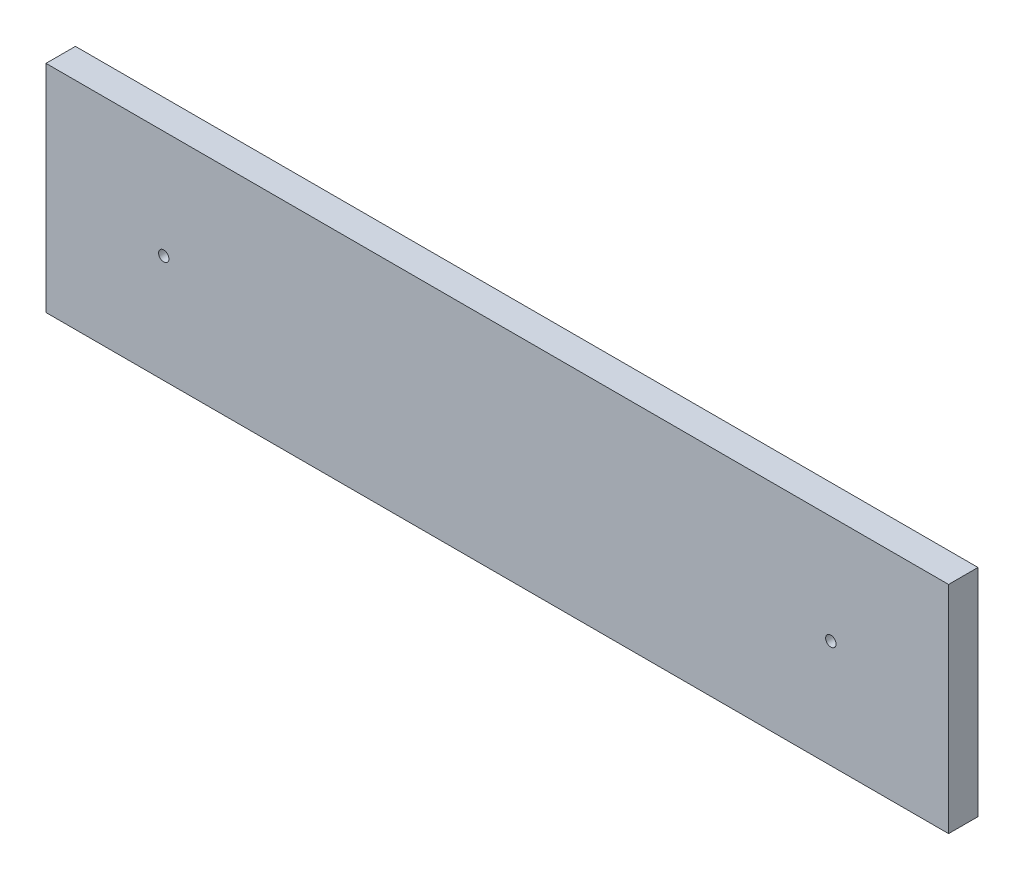
ISO-10303-21;
HEADER;
FILE_DESCRIPTION(('STEP AP214'),'2;1');
FILE_NAME('part.step','',(''),(''),'','','');
FILE_SCHEMA(('AUTOMOTIVE_DESIGN { 1 0 10303 214 1 1 1 1 }'));
ENDSEC;
DATA;
#1=APPLICATION_CONTEXT('core data for automotive mechanical design processes');
#2=APPLICATION_PROTOCOL_DEFINITION('international standard','automotive_design',2000,#1);
#3=PRODUCT_CONTEXT('',#1,'mechanical');
#4=PRODUCT('Part','Part','',(#3));
#5=PRODUCT_RELATED_PRODUCT_CATEGORY('part','',(#4));
#6=PRODUCT_DEFINITION_FORMATION('','',#4);
#7=PRODUCT_DEFINITION_CONTEXT('part definition',#1,'design');
#8=PRODUCT_DEFINITION('design','',#6,#7);
#9=PRODUCT_DEFINITION_SHAPE('','',#8);
#10=(LENGTH_UNIT() NAMED_UNIT(*) SI_UNIT(.MILLI.,.METRE.));
#11=(NAMED_UNIT(*) PLANE_ANGLE_UNIT() SI_UNIT($,.RADIAN.));
#12=(NAMED_UNIT(*) SI_UNIT($,.STERADIAN.) SOLID_ANGLE_UNIT());
#13=UNCERTAINTY_MEASURE_WITH_UNIT(LENGTH_MEASURE(1.E-05),#10,'distance_accuracy_value','');
#14=(GEOMETRIC_REPRESENTATION_CONTEXT(3) GLOBAL_UNCERTAINTY_ASSIGNED_CONTEXT((#13)) GLOBAL_UNIT_ASSIGNED_CONTEXT((#10,
#11,#12)) REPRESENTATION_CONTEXT('',''));
#15=CARTESIAN_POINT('',(0.,0.,0.));
#16=DIRECTION('',(0.,0.,1.));
#17=DIRECTION('',(1.,0.,0.));
#18=AXIS2_PLACEMENT_3D('',#15,#16,#17);
#19=CARTESIAN_POINT('',(0.,0.,-19.05));
#20=DIRECTION('',(0.,0.,-1.));
#21=DIRECTION('',(-1.,0.,0.));
#22=AXIS2_PLACEMENT_3D('',#19,#20,#21);
#23=PLANE('',#22);
#24=CARTESIAN_POINT('',(76.2,69.85,-19.05));
#25=DIRECTION('',(0.,0.,-1.));
#26=DIRECTION('',(-1.,0.,0.));
#27=AXIS2_PLACEMENT_3D('',#24,#25,#26);
#28=CIRCLE('',#27,3.3655);
#29=CARTESIAN_POINT('',(72.8345,69.85,-19.05));
#30=VERTEX_POINT('',#29);
#31=EDGE_CURVE('E83',#30,#30,#28,.F.);
#32=ORIENTED_EDGE('',*,*,#31,.T.);
#33=EDGE_LOOP('',(#32));
#34=FACE_BOUND('',#33,.T.);
#35=CARTESIAN_POINT('',(508.,69.85,-19.05));
#36=DIRECTION('',(0.,0.,-1.));
#37=DIRECTION('',(-1.,0.,0.));
#38=AXIS2_PLACEMENT_3D('',#35,#36,#37);
#39=CIRCLE('',#38,3.3655);
#40=CARTESIAN_POINT('',(504.6345,69.85,-19.05));
#41=VERTEX_POINT('',#40);
#42=EDGE_CURVE('E19',#41,#41,#39,.F.);
#43=ORIENTED_EDGE('',*,*,#42,.T.);
#44=EDGE_LOOP('',(#43));
#45=FACE_BOUND('',#44,.T.);
#46=DIRECTION('',(1.,0.,0.));
#47=VECTOR('',#46,1.);
#48=CARTESIAN_POINT('',(0.,0.,-19.05));
#49=LINE('',#48,#47);
#50=CARTESIAN_POINT('',(0.,0.,-19.05));
#51=VERTEX_POINT('',#50);
#52=CARTESIAN_POINT('',(584.2,0.,-19.05));
#53=VERTEX_POINT('',#52);
#54=EDGE_CURVE('E59',#51,#53,#49,.T.);
#55=ORIENTED_EDGE('',*,*,#54,.F.);
#56=DIRECTION('',(0.,1.,0.));
#57=VECTOR('',#56,1.);
#58=CARTESIAN_POINT('',(0.,0.,-19.05));
#59=LINE('',#58,#57);
#60=CARTESIAN_POINT('',(0.,139.7,-19.05));
#61=VERTEX_POINT('',#60);
#62=EDGE_CURVE('E92',#51,#61,#59,.T.);
#63=ORIENTED_EDGE('',*,*,#62,.T.);
#64=DIRECTION('',(1.,0.,0.));
#65=VECTOR('',#64,1.);
#66=CARTESIAN_POINT('',(0.,139.7,-19.05));
#67=LINE('',#66,#65);
#68=CARTESIAN_POINT('',(584.2,139.7,-19.05));
#69=VERTEX_POINT('',#68);
#70=EDGE_CURVE('E61',#69,#61,#67,.F.);
#71=ORIENTED_EDGE('',*,*,#70,.F.);
#72=DIRECTION('',(0.,1.,0.));
#73=VECTOR('',#72,1.);
#74=CARTESIAN_POINT('',(584.2,0.,-19.05));
#75=LINE('',#74,#73);
#76=EDGE_CURVE('E55',#53,#69,#75,.T.);
#77=ORIENTED_EDGE('',*,*,#76,.F.);
#78=EDGE_LOOP('',(#55,#63,#71,#77));
#79=FACE_BOUND('',#78,.T.);
#80=ADVANCED_FACE('F16',(#34,#45,#79),#23,.T.);
#81=CARTESIAN_POINT('',(0.,0.,0.));
#82=DIRECTION('',(0.,-1.,0.));
#83=DIRECTION('',(0.,0.,-1.));
#84=AXIS2_PLACEMENT_3D('',#81,#82,#83);
#85=PLANE('',#84);
#86=DIRECTION('',(1.,0.,0.));
#87=VECTOR('',#86,1.);
#88=CARTESIAN_POINT('',(0.,0.,0.));
#89=LINE('',#88,#87);
#90=CARTESIAN_POINT('',(0.,0.,0.));
#91=VERTEX_POINT('',#90);
#92=CARTESIAN_POINT('',(584.2,0.,0.));
#93=VERTEX_POINT('',#92);
#94=EDGE_CURVE('E85',#91,#93,#89,.T.);
#95=ORIENTED_EDGE('',*,*,#94,.F.);
#96=DIRECTION('',(0.,0.,-1.));
#97=VECTOR('',#96,1.);
#98=CARTESIAN_POINT('',(0.,0.,0.));
#99=LINE('',#98,#97);
#100=EDGE_CURVE('E69',#91,#51,#99,.T.);
#101=ORIENTED_EDGE('',*,*,#100,.T.);
#102=ORIENTED_EDGE('',*,*,#54,.T.);
#103=DIRECTION('',(0.,0.,-1.));
#104=VECTOR('',#103,1.);
#105=CARTESIAN_POINT('',(584.2,0.,0.));
#106=LINE('',#105,#104);
#107=EDGE_CURVE('E63',#93,#53,#106,.T.);
#108=ORIENTED_EDGE('',*,*,#107,.F.);
#109=EDGE_LOOP('',(#95,#101,#102,#108));
#110=FACE_BOUND('',#109,.T.);
#111=ADVANCED_FACE('F66',(#110),#85,.T.);
#112=CARTESIAN_POINT('',(584.2,0.,0.));
#113=DIRECTION('',(1.,0.,0.));
#114=DIRECTION('',(0.,0.,-1.));
#115=AXIS2_PLACEMENT_3D('',#112,#113,#114);
#116=PLANE('',#115);
#117=DIRECTION('',(0.,1.,0.));
#118=VECTOR('',#117,1.);
#119=CARTESIAN_POINT('',(584.2,139.7,0.));
#120=LINE('',#119,#118);
#121=CARTESIAN_POINT('',(584.2,139.7,0.));
#122=VERTEX_POINT('',#121);
#123=EDGE_CURVE('E74',#93,#122,#120,.T.);
#124=ORIENTED_EDGE('',*,*,#123,.F.);
#125=ORIENTED_EDGE('',*,*,#107,.T.);
#126=ORIENTED_EDGE('',*,*,#76,.T.);
#127=DIRECTION('',(0.,0.,1.));
#128=VECTOR('',#127,1.);
#129=CARTESIAN_POINT('',(584.2,139.7,-19.05));
#130=LINE('',#129,#128);
#131=EDGE_CURVE('E76',#122,#69,#130,.F.);
#132=ORIENTED_EDGE('',*,*,#131,.F.);
#133=EDGE_LOOP('',(#124,#125,#126,#132));
#134=FACE_BOUND('',#133,.T.);
#135=ADVANCED_FACE('F72',(#134),#116,.T.);
#136=CARTESIAN_POINT('',(0.,139.7,-19.05));
#137=DIRECTION('',(0.,1.,0.));
#138=DIRECTION('',(0.,0.,1.));
#139=AXIS2_PLACEMENT_3D('',#136,#137,#138);
#140=PLANE('',#139);
#141=ORIENTED_EDGE('',*,*,#70,.T.);
#142=DIRECTION('',(0.,0.,-1.));
#143=VECTOR('',#142,1.);
#144=CARTESIAN_POINT('',(0.,139.7,0.));
#145=LINE('',#144,#143);
#146=CARTESIAN_POINT('',(0.,139.7,0.));
#147=VERTEX_POINT('',#146);
#148=EDGE_CURVE('E34',#61,#147,#145,.F.);
#149=ORIENTED_EDGE('',*,*,#148,.T.);
#150=DIRECTION('',(1.,0.,0.));
#151=VECTOR('',#150,1.);
#152=CARTESIAN_POINT('',(0.,139.7,0.));
#153=LINE('',#152,#151);
#154=EDGE_CURVE('E103',#122,#147,#153,.F.);
#155=ORIENTED_EDGE('',*,*,#154,.F.);
#156=ORIENTED_EDGE('',*,*,#131,.T.);
#157=EDGE_LOOP('',(#141,#149,#155,#156));
#158=FACE_BOUND('',#157,.T.);
#159=ADVANCED_FACE('F97',(#158),#140,.T.);
#160=CARTESIAN_POINT('',(0.,0.,0.));
#161=DIRECTION('',(1.,0.,0.));
#162=DIRECTION('',(0.,0.,-1.));
#163=AXIS2_PLACEMENT_3D('',#160,#161,#162);
#164=PLANE('',#163);
#165=ORIENTED_EDGE('',*,*,#148,.F.);
#166=ORIENTED_EDGE('',*,*,#62,.F.);
#167=ORIENTED_EDGE('',*,*,#100,.F.);
#168=DIRECTION('',(0.,1.,0.));
#169=VECTOR('',#168,1.);
#170=CARTESIAN_POINT('',(0.,139.7,0.));
#171=LINE('',#170,#169);
#172=EDGE_CURVE('E82',#147,#91,#171,.F.);
#173=ORIENTED_EDGE('',*,*,#172,.F.);
#174=EDGE_LOOP('',(#165,#166,#167,#173));
#175=FACE_BOUND('',#174,.T.);
#176=ADVANCED_FACE('F99',(#175),#164,.F.);
#177=CARTESIAN_POINT('',(508.,69.85,-19.05));
#178=DIRECTION('',(0.,0.,-1.));
#179=DIRECTION('',(-1.,0.,0.));
#180=AXIS2_PLACEMENT_3D('',#177,#178,#179);
#181=CYLINDRICAL_SURFACE('',#180,3.3655);
#182=CARTESIAN_POINT('',(508.,69.85,0.));
#183=DIRECTION('',(0.,0.,-1.));
#184=DIRECTION('',(-1.,0.,0.));
#185=AXIS2_PLACEMENT_3D('',#182,#183,#184);
#186=CIRCLE('',#185,3.3655);
#187=CARTESIAN_POINT('',(504.6345,69.85,0.));
#188=VERTEX_POINT('',#187);
#189=EDGE_CURVE('E25',#188,#188,#186,.T.);
#190=ORIENTED_EDGE('',*,*,#189,.F.);
#191=EDGE_LOOP('',(#190));
#192=FACE_BOUND('',#191,.T.);
#193=ORIENTED_EDGE('',*,*,#42,.F.);
#194=EDGE_LOOP('',(#193));
#195=FACE_BOUND('',#194,.T.);
#196=ADVANCED_FACE('F115',(#192,#195),#181,.F.);
#197=CARTESIAN_POINT('',(76.2,69.85,-19.05));
#198=DIRECTION('',(0.,0.,-1.));
#199=DIRECTION('',(-1.,0.,0.));
#200=AXIS2_PLACEMENT_3D('',#197,#198,#199);
#201=CYLINDRICAL_SURFACE('',#200,3.3655);
#202=CARTESIAN_POINT('',(76.2,69.85,0.));
#203=DIRECTION('',(0.,0.,-1.));
#204=DIRECTION('',(-1.,0.,0.));
#205=AXIS2_PLACEMENT_3D('',#202,#203,#204);
#206=CIRCLE('',#205,3.3655);
#207=CARTESIAN_POINT('',(72.8345,69.85,0.));
#208=VERTEX_POINT('',#207);
#209=EDGE_CURVE('E11',#208,#208,#206,.T.);
#210=ORIENTED_EDGE('',*,*,#209,.F.);
#211=EDGE_LOOP('',(#210));
#212=FACE_BOUND('',#211,.T.);
#213=ORIENTED_EDGE('',*,*,#31,.F.);
#214=EDGE_LOOP('',(#213));
#215=FACE_BOUND('',#214,.T.);
#216=ADVANCED_FACE('F108',(#212,#215),#201,.F.);
#217=CARTESIAN_POINT('',(0.,139.7,0.));
#218=DIRECTION('',(0.,0.,1.));
#219=DIRECTION('',(1.,0.,0.));
#220=AXIS2_PLACEMENT_3D('',#217,#218,#219);
#221=PLANE('',#220);
#222=ORIENTED_EDGE('',*,*,#209,.T.);
#223=EDGE_LOOP('',(#222));
#224=FACE_BOUND('',#223,.T.);
#225=ORIENTED_EDGE('',*,*,#189,.T.);
#226=EDGE_LOOP('',(#225));
#227=FACE_BOUND('',#226,.T.);
#228=ORIENTED_EDGE('',*,*,#154,.T.);
#229=ORIENTED_EDGE('',*,*,#172,.T.);
#230=ORIENTED_EDGE('',*,*,#94,.T.);
#231=ORIENTED_EDGE('',*,*,#123,.T.);
#232=EDGE_LOOP('',(#228,#229,#230,#231));
#233=FACE_BOUND('',#232,.T.);
#234=ADVANCED_FACE('F105',(#224,#227,#233),#221,.T.);
#235=CLOSED_SHELL('',(#80,#111,#135,#159,#176,#196,#216,#234));
#236=MANIFOLD_SOLID_BREP('B1',#235);
#237=ADVANCED_BREP_SHAPE_REPRESENTATION('',(#18,#236),#14);
#238=SHAPE_DEFINITION_REPRESENTATION(#9,#237);
ENDSEC;
END-ISO-10303-21;
